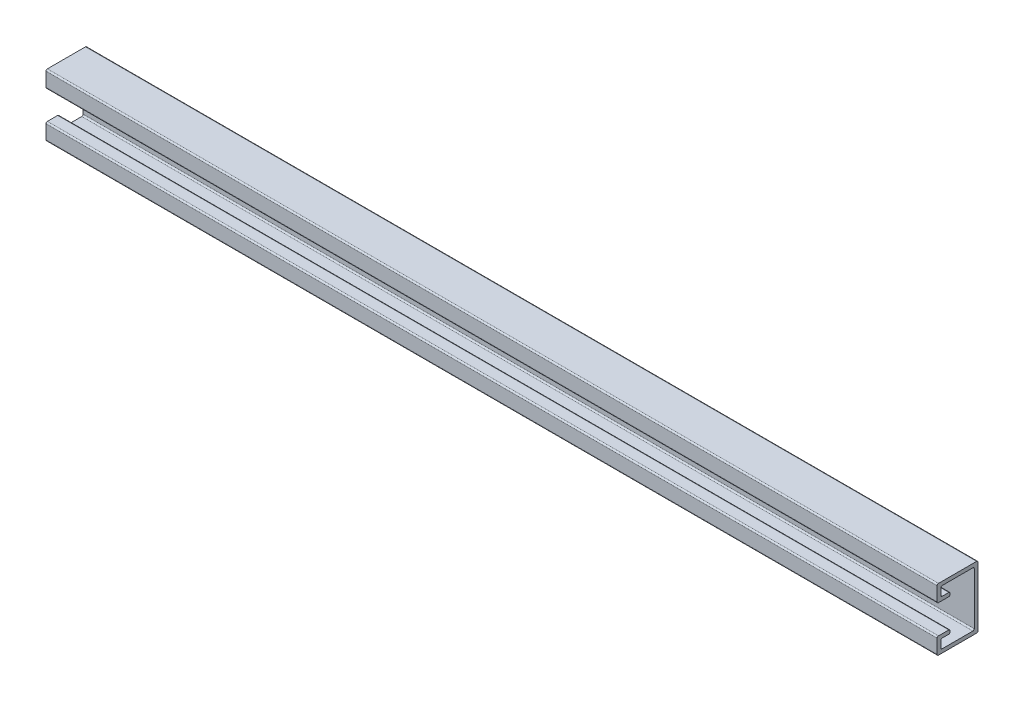
ISO-10303-21;
HEADER;
FILE_DESCRIPTION(('STEP AP214'),'2;1');
FILE_NAME('part.step','',(''),(''),'','','');
FILE_SCHEMA(('AUTOMOTIVE_DESIGN { 1 0 10303 214 1 1 1 1 }'));
ENDSEC;
DATA;
#1=APPLICATION_CONTEXT('core data for automotive mechanical design processes');
#2=APPLICATION_PROTOCOL_DEFINITION('international standard','automotive_design',2000,#1);
#3=PRODUCT_CONTEXT('',#1,'mechanical');
#4=PRODUCT('Part','Part','',(#3));
#5=PRODUCT_RELATED_PRODUCT_CATEGORY('part','',(#4));
#6=PRODUCT_DEFINITION_FORMATION('','',#4);
#7=PRODUCT_DEFINITION_CONTEXT('part definition',#1,'design');
#8=PRODUCT_DEFINITION('design','',#6,#7);
#9=PRODUCT_DEFINITION_SHAPE('','',#8);
#10=(LENGTH_UNIT() NAMED_UNIT(*) SI_UNIT(.MILLI.,.METRE.));
#11=(NAMED_UNIT(*) PLANE_ANGLE_UNIT() SI_UNIT($,.RADIAN.));
#12=(NAMED_UNIT(*) SI_UNIT($,.STERADIAN.) SOLID_ANGLE_UNIT());
#13=UNCERTAINTY_MEASURE_WITH_UNIT(LENGTH_MEASURE(1.E-05),#10,'distance_accuracy_value','');
#14=(GEOMETRIC_REPRESENTATION_CONTEXT(3) GLOBAL_UNCERTAINTY_ASSIGNED_CONTEXT((#13)) GLOBAL_UNIT_ASSIGNED_CONTEXT((#10,
#11,#12)) REPRESENTATION_CONTEXT('',''));
#15=CARTESIAN_POINT('',(0.,0.,0.));
#16=DIRECTION('',(0.,0.,1.));
#17=DIRECTION('',(1.,0.,0.));
#18=AXIS2_PLACEMENT_3D('',#15,#16,#17);
#19=CARTESIAN_POINT('',(1219.2,12.7,45.72));
#20=DIRECTION('',(0.,1.,0.));
#21=DIRECTION('',(0.,0.,1.));
#22=AXIS2_PLACEMENT_3D('',#19,#20,#21);
#23=PLANE('',#22);
#24=DIRECTION('',(0.,0.,-1.));
#25=VECTOR('',#24,1.);
#26=CARTESIAN_POINT('',(1219.2,12.7,45.72));
#27=LINE('',#26,#25);
#28=CARTESIAN_POINT('',(1219.2,12.7,43.815));
#29=VERTEX_POINT('',#28);
#30=CARTESIAN_POINT('',(1219.2,12.7,34.925));
#31=VERTEX_POINT('',#30);
#32=EDGE_CURVE('E245',#29,#31,#27,.T.);
#33=ORIENTED_EDGE('',*,*,#32,.F.);
#34=DIRECTION('',(-1.,0.,0.));
#35=VECTOR('',#34,1.);
#36=CARTESIAN_POINT('',(0.,12.7,43.815));
#37=LINE('',#36,#35);
#38=CARTESIAN_POINT('',(0.,12.7,43.815));
#39=VERTEX_POINT('',#38);
#40=EDGE_CURVE('E229',#29,#39,#37,.T.);
#41=ORIENTED_EDGE('',*,*,#40,.T.);
#42=DIRECTION('',(0.,0.,-1.));
#43=VECTOR('',#42,1.);
#44=CARTESIAN_POINT('',(0.,12.7,45.72));
#45=LINE('',#44,#43);
#46=CARTESIAN_POINT('',(0.,12.7,34.925));
#47=VERTEX_POINT('',#46);
#48=EDGE_CURVE('E242',#39,#47,#45,.T.);
#49=ORIENTED_EDGE('',*,*,#48,.T.);
#50=DIRECTION('',(-1.,0.,0.));
#51=VECTOR('',#50,1.);
#52=CARTESIAN_POINT('',(1219.2,12.7,34.925));
#53=LINE('',#52,#51);
#54=EDGE_CURVE('E248',#47,#31,#53,.F.);
#55=ORIENTED_EDGE('',*,*,#54,.T.);
#56=EDGE_LOOP('',(#33,#41,#49,#55));
#57=FACE_BOUND('',#56,.T.);
#58=ADVANCED_FACE('F14',(#57),#23,.F.);
#59=CARTESIAN_POINT('',(1219.2,17.78,33.02));
#60=DIRECTION('',(0.,0.,-1.));
#61=DIRECTION('',(-1.,0.,0.));
#62=AXIS2_PLACEMENT_3D('',#59,#60,#61);
#63=PLANE('',#62);
#64=DIRECTION('',(0.,-1.,0.));
#65=VECTOR('',#64,1.);
#66=CARTESIAN_POINT('',(1219.2,17.78,33.02));
#67=LINE('',#66,#65);
#68=CARTESIAN_POINT('',(1219.2,15.875,33.02));
#69=VERTEX_POINT('',#68);
#70=CARTESIAN_POINT('',(1219.2,14.605,33.02));
#71=VERTEX_POINT('',#70);
#72=EDGE_CURVE('E570',#69,#71,#67,.T.);
#73=ORIENTED_EDGE('',*,*,#72,.T.);
#74=DIRECTION('',(-1.,0.,0.));
#75=VECTOR('',#74,1.);
#76=CARTESIAN_POINT('',(0.,14.605,33.02));
#77=LINE('',#76,#75);
#78=CARTESIAN_POINT('',(0.,14.605,33.02));
#79=VERTEX_POINT('',#78);
#80=EDGE_CURVE('E448',#71,#79,#77,.T.);
#81=ORIENTED_EDGE('',*,*,#80,.T.);
#82=DIRECTION('',(0.,-1.,0.));
#83=VECTOR('',#82,1.);
#84=CARTESIAN_POINT('',(0.,17.78,33.02));
#85=LINE('',#84,#83);
#86=CARTESIAN_POINT('',(0.,15.875,33.02));
#87=VERTEX_POINT('',#86);
#88=EDGE_CURVE('E255',#87,#79,#85,.T.);
#89=ORIENTED_EDGE('',*,*,#88,.F.);
#90=DIRECTION('',(-1.,0.,0.));
#91=VECTOR('',#90,1.);
#92=CARTESIAN_POINT('',(1219.2,15.875,33.02));
#93=LINE('',#92,#91);
#94=EDGE_CURVE('E445',#87,#69,#93,.F.);
#95=ORIENTED_EDGE('',*,*,#94,.T.);
#96=EDGE_LOOP('',(#73,#81,#89,#95));
#97=FACE_BOUND('',#96,.T.);
#98=ADVANCED_FACE('F583',(#97),#63,.T.);
#99=CARTESIAN_POINT('',(1219.2,17.78,45.72));
#100=DIRECTION('',(0.,1.,0.));
#101=DIRECTION('',(0.,0.,1.));
#102=AXIS2_PLACEMENT_3D('',#99,#100,#101);
#103=PLANE('',#102);
#104=DIRECTION('',(0.,0.,-1.));
#105=VECTOR('',#104,1.);
#106=CARTESIAN_POINT('',(0.,17.78,45.72));
#107=LINE('',#106,#105);
#108=CARTESIAN_POINT('',(0.,17.78,48.895));
#109=VERTEX_POINT('',#108);
#110=CARTESIAN_POINT('',(0.,17.78,34.925));
#111=VERTEX_POINT('',#110);
#112=EDGE_CURVE('E259',#109,#111,#107,.T.);
#113=ORIENTED_EDGE('',*,*,#112,.F.);
#114=DIRECTION('',(-1.,0.,0.));
#115=VECTOR('',#114,1.);
#116=CARTESIAN_POINT('',(1219.2,17.78,48.895));
#117=LINE('',#116,#115);
#118=CARTESIAN_POINT('',(1219.2,17.78,48.895));
#119=VERTEX_POINT('',#118);
#120=EDGE_CURVE('E442',#109,#119,#117,.F.);
#121=ORIENTED_EDGE('',*,*,#120,.T.);
#122=DIRECTION('',(0.,0.,-1.));
#123=VECTOR('',#122,1.);
#124=CARTESIAN_POINT('',(1219.2,17.78,45.72));
#125=LINE('',#124,#123);
#126=CARTESIAN_POINT('',(1219.2,17.78,34.925));
#127=VERTEX_POINT('',#126);
#128=EDGE_CURVE('E566',#119,#127,#125,.T.);
#129=ORIENTED_EDGE('',*,*,#128,.T.);
#130=DIRECTION('',(-1.,0.,0.));
#131=VECTOR('',#130,1.);
#132=CARTESIAN_POINT('',(1219.2,17.78,34.925));
#133=LINE('',#132,#131);
#134=EDGE_CURVE('E438',#127,#111,#133,.T.);
#135=ORIENTED_EDGE('',*,*,#134,.T.);
#136=EDGE_LOOP('',(#113,#121,#129,#135));
#137=FACE_BOUND('',#136,.T.);
#138=ADVANCED_FACE('F591',(#137),#103,.T.);
#139=CARTESIAN_POINT('',(1219.2,0.,50.8));
#140=DIRECTION('',(0.,0.,1.));
#141=DIRECTION('',(0.,-1.,0.));
#142=AXIS2_PLACEMENT_3D('',#139,#140,#141);
#143=PLANE('',#142);
#144=DIRECTION('',(0.,1.,0.));
#145=VECTOR('',#144,1.);
#146=CARTESIAN_POINT('',(0.,0.,50.8));
#147=LINE('',#146,#145);
#148=CARTESIAN_POINT('',(0.,-3.175,50.8));
#149=VERTEX_POINT('',#148);
#150=CARTESIAN_POINT('',(0.,15.875,50.8));
#151=VERTEX_POINT('',#150);
#152=EDGE_CURVE('E268',#149,#151,#147,.T.);
#153=ORIENTED_EDGE('',*,*,#152,.F.);
#154=DIRECTION('',(-1.,0.,0.));
#155=VECTOR('',#154,1.);
#156=CARTESIAN_POINT('',(1219.2,-3.175,50.8));
#157=LINE('',#156,#155);
#158=CARTESIAN_POINT('',(1219.2,-3.175,50.8));
#159=VERTEX_POINT('',#158);
#160=EDGE_CURVE('E408',#149,#159,#157,.F.);
#161=ORIENTED_EDGE('',*,*,#160,.T.);
#162=DIRECTION('',(0.,1.,0.));
#163=VECTOR('',#162,1.);
#164=CARTESIAN_POINT('',(1219.2,0.,50.8));
#165=LINE('',#164,#163);
#166=CARTESIAN_POINT('',(1219.2,15.875,50.8));
#167=VERTEX_POINT('',#166);
#168=EDGE_CURVE('E562',#159,#167,#165,.T.);
#169=ORIENTED_EDGE('',*,*,#168,.T.);
#170=DIRECTION('',(-1.,0.,0.));
#171=VECTOR('',#170,1.);
#172=CARTESIAN_POINT('',(1219.2,15.875,50.8));
#173=LINE('',#172,#171);
#174=EDGE_CURVE('E404',#167,#151,#173,.T.);
#175=ORIENTED_EDGE('',*,*,#174,.T.);
#176=EDGE_LOOP('',(#153,#161,#169,#175));
#177=FACE_BOUND('',#176,.T.);
#178=ADVANCED_FACE('F601',(#177),#143,.T.);
#179=CARTESIAN_POINT('',(1219.2,-5.08,0.));
#180=DIRECTION('',(0.,-1.,0.));
#181=DIRECTION('',(0.,0.,-1.));
#182=AXIS2_PLACEMENT_3D('',#179,#180,#181);
#183=PLANE('',#182);
#184=DIRECTION('',(0.,0.,-1.));
#185=VECTOR('',#184,1.);
#186=CARTESIAN_POINT('',(1219.2,-5.08,0.));
#187=LINE('',#186,#185);
#188=CARTESIAN_POINT('',(1219.2,-5.08,-3.175));
#189=VERTEX_POINT('',#188);
#190=CARTESIAN_POINT('',(1219.2,-5.08,48.895));
#191=VERTEX_POINT('',#190);
#192=EDGE_CURVE('E558',#189,#191,#187,.F.);
#193=ORIENTED_EDGE('',*,*,#192,.T.);
#194=DIRECTION('',(-1.,0.,0.));
#195=VECTOR('',#194,1.);
#196=CARTESIAN_POINT('',(1219.2,-5.08,48.895));
#197=LINE('',#196,#195);
#198=CARTESIAN_POINT('',(0.,-5.08,48.895));
#199=VERTEX_POINT('',#198);
#200=EDGE_CURVE('E400',#191,#199,#197,.T.);
#201=ORIENTED_EDGE('',*,*,#200,.T.);
#202=DIRECTION('',(0.,0.,-1.));
#203=VECTOR('',#202,1.);
#204=CARTESIAN_POINT('',(0.,-5.08,0.));
#205=LINE('',#204,#203);
#206=CARTESIAN_POINT('',(0.,-5.08,-3.175));
#207=VERTEX_POINT('',#206);
#208=EDGE_CURVE('E272',#207,#199,#205,.F.);
#209=ORIENTED_EDGE('',*,*,#208,.F.);
#210=DIRECTION('',(-1.,0.,0.));
#211=VECTOR('',#210,1.);
#212=CARTESIAN_POINT('',(1219.2,-5.08,-3.175));
#213=LINE('',#212,#211);
#214=EDGE_CURVE('E397',#207,#189,#213,.F.);
#215=ORIENTED_EDGE('',*,*,#214,.T.);
#216=EDGE_LOOP('',(#193,#201,#209,#215));
#217=FACE_BOUND('',#216,.T.);
#218=ADVANCED_FACE('F609',(#217),#183,.T.);
#219=CARTESIAN_POINT('',(1219.2,0.,-5.08));
#220=DIRECTION('',(0.,0.,-1.));
#221=DIRECTION('',(-1.,0.,0.));
#222=AXIS2_PLACEMENT_3D('',#219,#220,#221);
#223=PLANE('',#222);
#224=DIRECTION('',(0.,1.,0.));
#225=VECTOR('',#224,1.);
#226=CARTESIAN_POINT('',(1219.2,0.,-5.08));
#227=LINE('',#226,#225);
#228=CARTESIAN_POINT('',(1219.2,78.105,-5.08));
#229=VERTEX_POINT('',#228);
#230=CARTESIAN_POINT('',(1219.2,-3.175,-5.08));
#231=VERTEX_POINT('',#230);
#232=EDGE_CURVE('E554',#229,#231,#227,.F.);
#233=ORIENTED_EDGE('',*,*,#232,.T.);
#234=DIRECTION('',(-1.,0.,0.));
#235=VECTOR('',#234,1.);
#236=CARTESIAN_POINT('',(1219.2,-3.175,-5.08));
#237=LINE('',#236,#235);
#238=CARTESIAN_POINT('',(0.,-3.175,-5.08));
#239=VERTEX_POINT('',#238);
#240=EDGE_CURVE('E427',#231,#239,#237,.T.);
#241=ORIENTED_EDGE('',*,*,#240,.T.);
#242=DIRECTION('',(0.,1.,0.));
#243=VECTOR('',#242,1.);
#244=CARTESIAN_POINT('',(0.,0.,-5.08));
#245=LINE('',#244,#243);
#246=CARTESIAN_POINT('',(0.,78.105,-5.08));
#247=VERTEX_POINT('',#246);
#248=EDGE_CURVE('E276',#247,#239,#245,.F.);
#249=ORIENTED_EDGE('',*,*,#248,.F.);
#250=DIRECTION('',(-1.,0.,0.));
#251=VECTOR('',#250,1.);
#252=CARTESIAN_POINT('',(1219.2,78.105,-5.08));
#253=LINE('',#252,#251);
#254=EDGE_CURVE('E424',#247,#229,#253,.F.);
#255=ORIENTED_EDGE('',*,*,#254,.T.);
#256=EDGE_LOOP('',(#233,#241,#249,#255));
#257=FACE_BOUND('',#256,.T.);
#258=ADVANCED_FACE('F619',(#257),#223,.T.);
#259=CARTESIAN_POINT('',(1219.2,80.01,0.));
#260=DIRECTION('',(0.,1.,0.));
#261=DIRECTION('',(0.,0.,1.));
#262=AXIS2_PLACEMENT_3D('',#259,#260,#261);
#263=PLANE('',#262);
#264=DIRECTION('',(0.,0.,-1.));
#265=VECTOR('',#264,1.);
#266=CARTESIAN_POINT('',(0.,80.01,0.));
#267=LINE('',#266,#265);
#268=CARTESIAN_POINT('',(0.,80.01,48.895));
#269=VERTEX_POINT('',#268);
#270=CARTESIAN_POINT('',(0.,80.01,-3.175));
#271=VERTEX_POINT('',#270);
#272=EDGE_CURVE('E280',#269,#271,#267,.T.);
#273=ORIENTED_EDGE('',*,*,#272,.F.);
#274=DIRECTION('',(-1.,0.,0.));
#275=VECTOR('',#274,1.);
#276=CARTESIAN_POINT('',(1219.2,80.01,48.895));
#277=LINE('',#276,#275);
#278=CARTESIAN_POINT('',(1219.2,80.01,48.895));
#279=VERTEX_POINT('',#278);
#280=EDGE_CURVE('E435',#269,#279,#277,.F.);
#281=ORIENTED_EDGE('',*,*,#280,.T.);
#282=DIRECTION('',(0.,0.,-1.));
#283=VECTOR('',#282,1.);
#284=CARTESIAN_POINT('',(1219.2,80.01,0.));
#285=LINE('',#284,#283);
#286=CARTESIAN_POINT('',(1219.2,80.01,-3.175));
#287=VERTEX_POINT('',#286);
#288=EDGE_CURVE('E550',#279,#287,#285,.T.);
#289=ORIENTED_EDGE('',*,*,#288,.T.);
#290=DIRECTION('',(-1.,0.,0.));
#291=VECTOR('',#290,1.);
#292=CARTESIAN_POINT('',(1219.2,80.01,-3.175));
#293=LINE('',#292,#291);
#294=EDGE_CURVE('E431',#287,#271,#293,.T.);
#295=ORIENTED_EDGE('',*,*,#294,.T.);
#296=EDGE_LOOP('',(#273,#281,#289,#295));
#297=FACE_BOUND('',#296,.T.);
#298=ADVANCED_FACE('F627',(#297),#263,.T.);
#299=CARTESIAN_POINT('',(1219.2,74.93,50.8));
#300=DIRECTION('',(0.,0.,1.));
#301=DIRECTION('',(1.,0.,0.));
#302=AXIS2_PLACEMENT_3D('',#299,#300,#301);
#303=PLANE('',#302);
#304=DIRECTION('',(0.,1.,0.));
#305=VECTOR('',#304,1.);
#306=CARTESIAN_POINT('',(0.,74.93,50.8));
#307=LINE('',#306,#305);
#308=CARTESIAN_POINT('',(0.,59.055,50.8));
#309=VERTEX_POINT('',#308);
#310=CARTESIAN_POINT('',(0.,78.105,50.8));
#311=VERTEX_POINT('',#310);
#312=EDGE_CURVE('E284',#309,#311,#307,.T.);
#313=ORIENTED_EDGE('',*,*,#312,.F.);
#314=DIRECTION('',(-1.,0.,0.));
#315=VECTOR('',#314,1.);
#316=CARTESIAN_POINT('',(1219.2,59.055,50.8));
#317=LINE('',#316,#315);
#318=CARTESIAN_POINT('',(1219.2,59.055,50.8));
#319=VERTEX_POINT('',#318);
#320=EDGE_CURVE('E364',#309,#319,#317,.F.);
#321=ORIENTED_EDGE('',*,*,#320,.T.);
#322=DIRECTION('',(0.,1.,0.));
#323=VECTOR('',#322,1.);
#324=CARTESIAN_POINT('',(1219.2,74.93,50.8));
#325=LINE('',#324,#323);
#326=CARTESIAN_POINT('',(1219.2,78.105,50.8));
#327=VERTEX_POINT('',#326);
#328=EDGE_CURVE('E546',#319,#327,#325,.T.);
#329=ORIENTED_EDGE('',*,*,#328,.T.);
#330=DIRECTION('',(-1.,0.,0.));
#331=VECTOR('',#330,1.);
#332=CARTESIAN_POINT('',(1219.2,78.105,50.8));
#333=LINE('',#332,#331);
#334=EDGE_CURVE('E360',#327,#311,#333,.T.);
#335=ORIENTED_EDGE('',*,*,#334,.T.);
#336=EDGE_LOOP('',(#313,#321,#329,#335));
#337=FACE_BOUND('',#336,.T.);
#338=ADVANCED_FACE('F636',(#337),#303,.T.);
#339=CARTESIAN_POINT('',(1219.2,57.15,45.72));
#340=DIRECTION('',(0.,-1.,0.));
#341=DIRECTION('',(0.,0.,-1.));
#342=AXIS2_PLACEMENT_3D('',#339,#340,#341);
#343=PLANE('',#342);
#344=DIRECTION('',(0.,0.,1.));
#345=VECTOR('',#344,1.);
#346=CARTESIAN_POINT('',(1219.2,57.15,45.72));
#347=LINE('',#346,#345);
#348=CARTESIAN_POINT('',(1219.2,57.15,34.925));
#349=VERTEX_POINT('',#348);
#350=CARTESIAN_POINT('',(1219.2,57.15,48.895));
#351=VERTEX_POINT('',#350);
#352=EDGE_CURVE('E542',#349,#351,#347,.T.);
#353=ORIENTED_EDGE('',*,*,#352,.T.);
#354=DIRECTION('',(-1.,0.,0.));
#355=VECTOR('',#354,1.);
#356=CARTESIAN_POINT('',(1219.2,57.15,48.895));
#357=LINE('',#356,#355);
#358=CARTESIAN_POINT('',(0.,57.15,48.895));
#359=VERTEX_POINT('',#358);
#360=EDGE_CURVE('E327',#351,#359,#357,.T.);
#361=ORIENTED_EDGE('',*,*,#360,.T.);
#362=DIRECTION('',(0.,0.,1.));
#363=VECTOR('',#362,1.);
#364=CARTESIAN_POINT('',(0.,57.15,45.72));
#365=LINE('',#364,#363);
#366=CARTESIAN_POINT('',(0.,57.15,34.925));
#367=VERTEX_POINT('',#366);
#368=EDGE_CURVE('E288',#367,#359,#365,.T.);
#369=ORIENTED_EDGE('',*,*,#368,.F.);
#370=DIRECTION('',(-1.,0.,0.));
#371=VECTOR('',#370,1.);
#372=CARTESIAN_POINT('',(1219.2,57.15,34.925));
#373=LINE('',#372,#371);
#374=EDGE_CURVE('E324',#367,#349,#373,.F.);
#375=ORIENTED_EDGE('',*,*,#374,.T.);
#376=EDGE_LOOP('',(#353,#361,#369,#375));
#377=FACE_BOUND('',#376,.T.);
#378=ADVANCED_FACE('F644',(#377),#343,.T.);
#379=CARTESIAN_POINT('',(1219.2,62.23,33.02));
#380=DIRECTION('',(0.,0.,-1.));
#381=DIRECTION('',(-1.,0.,0.));
#382=AXIS2_PLACEMENT_3D('',#379,#380,#381);
#383=PLANE('',#382);
#384=DIRECTION('',(0.,-1.,0.));
#385=VECTOR('',#384,1.);
#386=CARTESIAN_POINT('',(1219.2,62.23,33.02));
#387=LINE('',#386,#385);
#388=CARTESIAN_POINT('',(1219.2,60.325,33.02));
#389=VERTEX_POINT('',#388);
#390=CARTESIAN_POINT('',(1219.2,59.055,33.02));
#391=VERTEX_POINT('',#390);
#392=EDGE_CURVE('E538',#389,#391,#387,.T.);
#393=ORIENTED_EDGE('',*,*,#392,.T.);
#394=DIRECTION('',(-1.,0.,0.));
#395=VECTOR('',#394,1.);
#396=CARTESIAN_POINT('',(1219.2,59.055,33.02));
#397=LINE('',#396,#395);
#398=CARTESIAN_POINT('',(0.,59.055,33.02));
#399=VERTEX_POINT('',#398);
#400=EDGE_CURVE('E455',#391,#399,#397,.T.);
#401=ORIENTED_EDGE('',*,*,#400,.T.);
#402=DIRECTION('',(0.,-1.,0.));
#403=VECTOR('',#402,1.);
#404=CARTESIAN_POINT('',(0.,62.23,33.02));
#405=LINE('',#404,#403);
#406=CARTESIAN_POINT('',(0.,60.325,33.02));
#407=VERTEX_POINT('',#406);
#408=EDGE_CURVE('E291',#407,#399,#405,.T.);
#409=ORIENTED_EDGE('',*,*,#408,.F.);
#410=DIRECTION('',(-1.,0.,0.));
#411=VECTOR('',#410,1.);
#412=CARTESIAN_POINT('',(1219.2,60.325,33.02));
#413=LINE('',#412,#411);
#414=EDGE_CURVE('E452',#407,#389,#413,.F.);
#415=ORIENTED_EDGE('',*,*,#414,.T.);
#416=EDGE_LOOP('',(#393,#401,#409,#415));
#417=FACE_BOUND('',#416,.T.);
#418=ADVANCED_FACE('F654',(#417),#383,.T.);
#419=CARTESIAN_POINT('',(1219.2,62.23,45.72));
#420=DIRECTION('',(0.,-1.,0.));
#421=DIRECTION('',(0.,0.,-1.));
#422=AXIS2_PLACEMENT_3D('',#419,#420,#421);
#423=PLANE('',#422);
#424=DIRECTION('',(0.,0.,1.));
#425=VECTOR('',#424,1.);
#426=CARTESIAN_POINT('',(1219.2,62.23,45.72));
#427=LINE('',#426,#425);
#428=CARTESIAN_POINT('',(1219.2,62.23,34.925));
#429=VERTEX_POINT('',#428);
#430=CARTESIAN_POINT('',(1219.2,62.23,43.815));
#431=VERTEX_POINT('',#430);
#432=EDGE_CURVE('E534',#429,#431,#427,.T.);
#433=ORIENTED_EDGE('',*,*,#432,.F.);
#434=DIRECTION('',(-1.,0.,0.));
#435=VECTOR('',#434,1.);
#436=CARTESIAN_POINT('',(0.,62.23,34.925));
#437=LINE('',#436,#435);
#438=CARTESIAN_POINT('',(0.,62.23,34.925));
#439=VERTEX_POINT('',#438);
#440=EDGE_CURVE('E462',#429,#439,#437,.T.);
#441=ORIENTED_EDGE('',*,*,#440,.T.);
#442=DIRECTION('',(0.,0.,1.));
#443=VECTOR('',#442,1.);
#444=CARTESIAN_POINT('',(0.,62.23,45.72));
#445=LINE('',#444,#443);
#446=CARTESIAN_POINT('',(0.,62.23,43.815));
#447=VERTEX_POINT('',#446);
#448=EDGE_CURVE('E295',#439,#447,#445,.T.);
#449=ORIENTED_EDGE('',*,*,#448,.T.);
#450=DIRECTION('',(-1.,0.,0.));
#451=VECTOR('',#450,1.);
#452=CARTESIAN_POINT('',(1219.2,62.23,43.815));
#453=LINE('',#452,#451);
#454=EDGE_CURVE('E459',#447,#431,#453,.F.);
#455=ORIENTED_EDGE('',*,*,#454,.T.);
#456=EDGE_LOOP('',(#433,#441,#449,#455));
#457=FACE_BOUND('',#456,.T.);
#458=ADVANCED_FACE('F663',(#457),#423,.F.);
#459=CARTESIAN_POINT('',(1219.2,74.93,45.72));
#460=DIRECTION('',(0.,0.,1.));
#461=DIRECTION('',(1.,0.,0.));
#462=AXIS2_PLACEMENT_3D('',#459,#460,#461);
#463=PLANE('',#462);
#464=DIRECTION('',(0.,1.,0.));
#465=VECTOR('',#464,1.);
#466=CARTESIAN_POINT('',(1219.2,74.93,45.72));
#467=LINE('',#466,#465);
#468=CARTESIAN_POINT('',(1219.2,64.135,45.72));
#469=VERTEX_POINT('',#468);
#470=CARTESIAN_POINT('',(1219.2,73.025,45.72));
#471=VERTEX_POINT('',#470);
#472=EDGE_CURVE('E528',#469,#471,#467,.T.);
#473=ORIENTED_EDGE('',*,*,#472,.F.);
#474=DIRECTION('',(-1.,0.,0.));
#475=VECTOR('',#474,1.);
#476=CARTESIAN_POINT('',(0.,64.135,45.72));
#477=LINE('',#476,#475);
#478=CARTESIAN_POINT('',(0.,64.135,45.72));
#479=VERTEX_POINT('',#478);
#480=EDGE_CURVE('E469',#469,#479,#477,.T.);
#481=ORIENTED_EDGE('',*,*,#480,.T.);
#482=DIRECTION('',(0.,1.,0.));
#483=VECTOR('',#482,1.);
#484=CARTESIAN_POINT('',(0.,74.93,45.72));
#485=LINE('',#484,#483);
#486=CARTESIAN_POINT('',(0.,73.025,45.72));
#487=VERTEX_POINT('',#486);
#488=EDGE_CURVE('E299',#479,#487,#485,.T.);
#489=ORIENTED_EDGE('',*,*,#488,.T.);
#490=DIRECTION('',(-1.,0.,0.));
#491=VECTOR('',#490,1.);
#492=CARTESIAN_POINT('',(1219.2,73.025,45.72));
#493=LINE('',#492,#491);
#494=EDGE_CURVE('E466',#487,#471,#493,.F.);
#495=ORIENTED_EDGE('',*,*,#494,.T.);
#496=EDGE_LOOP('',(#473,#481,#489,#495));
#497=FACE_BOUND('',#496,.T.);
#498=ADVANCED_FACE('F672',(#497),#463,.F.);
#499=CARTESIAN_POINT('',(1219.2,74.93,0.));
#500=DIRECTION('',(0.,1.,0.));
#501=DIRECTION('',(0.,0.,1.));
#502=AXIS2_PLACEMENT_3D('',#499,#500,#501);
#503=PLANE('',#502);
#504=DIRECTION('',(0.,0.,-1.));
#505=VECTOR('',#504,1.);
#506=CARTESIAN_POINT('',(1219.2,74.93,0.));
#507=LINE('',#506,#505);
#508=CARTESIAN_POINT('',(1219.2,74.93,43.815));
#509=VERTEX_POINT('',#508);
#510=CARTESIAN_POINT('',(1219.2,74.93,1.905));
#511=VERTEX_POINT('',#510);
#512=EDGE_CURVE('E519',#509,#511,#507,.T.);
#513=ORIENTED_EDGE('',*,*,#512,.F.);
#514=DIRECTION('',(-1.,0.,0.));
#515=VECTOR('',#514,1.);
#516=CARTESIAN_POINT('',(0.,74.93,43.815));
#517=LINE('',#516,#515);
#518=CARTESIAN_POINT('',(0.,74.93,43.815));
#519=VERTEX_POINT('',#518);
#520=EDGE_CURVE('E237',#509,#519,#517,.T.);
#521=ORIENTED_EDGE('',*,*,#520,.T.);
#522=DIRECTION('',(0.,0.,-1.));
#523=VECTOR('',#522,1.);
#524=CARTESIAN_POINT('',(0.,74.93,0.));
#525=LINE('',#524,#523);
#526=CARTESIAN_POINT('',(0.,74.93,1.905));
#527=VERTEX_POINT('',#526);
#528=EDGE_CURVE('E303',#519,#527,#525,.T.);
#529=ORIENTED_EDGE('',*,*,#528,.T.);
#530=DIRECTION('',(-1.,0.,0.));
#531=VECTOR('',#530,1.);
#532=CARTESIAN_POINT('',(1219.2,74.93,1.905));
#533=LINE('',#532,#531);
#534=EDGE_CURVE('E473',#527,#511,#533,.F.);
#535=ORIENTED_EDGE('',*,*,#534,.T.);
#536=EDGE_LOOP('',(#513,#521,#529,#535));
#537=FACE_BOUND('',#536,.T.);
#538=ADVANCED_FACE('F511',(#537),#503,.F.);
#539=CARTESIAN_POINT('',(1219.2,0.,0.));
#540=DIRECTION('',(0.,0.,-1.));
#541=DIRECTION('',(-1.,0.,0.));
#542=AXIS2_PLACEMENT_3D('',#539,#540,#541);
#543=PLANE('',#542);
#544=DIRECTION('',(0.,-1.,0.));
#545=VECTOR('',#544,1.);
#546=CARTESIAN_POINT('',(0.,0.,0.));
#547=LINE('',#546,#545);
#548=CARTESIAN_POINT('',(0.,73.025,0.));
#549=VERTEX_POINT('',#548);
#550=CARTESIAN_POINT('',(0.,1.905,0.));
#551=VERTEX_POINT('',#550);
#552=EDGE_CURVE('E307',#549,#551,#547,.T.);
#553=ORIENTED_EDGE('',*,*,#552,.T.);
#554=DIRECTION('',(-1.,0.,0.));
#555=VECTOR('',#554,1.);
#556=CARTESIAN_POINT('',(1219.2,1.905,0.));
#557=LINE('',#556,#555);
#558=CARTESIAN_POINT('',(1219.2,1.905,0.));
#559=VERTEX_POINT('',#558);
#560=EDGE_CURVE('E421',#551,#559,#557,.F.);
#561=ORIENTED_EDGE('',*,*,#560,.T.);
#562=DIRECTION('',(0.,-1.,0.));
#563=VECTOR('',#562,1.);
#564=CARTESIAN_POINT('',(1219.2,0.,0.));
#565=LINE('',#564,#563);
#566=CARTESIAN_POINT('',(1219.2,73.025,0.));
#567=VERTEX_POINT('',#566);
#568=EDGE_CURVE('E518',#567,#559,#565,.T.);
#569=ORIENTED_EDGE('',*,*,#568,.F.);
#570=DIRECTION('',(-1.,0.,0.));
#571=VECTOR('',#570,1.);
#572=CARTESIAN_POINT('',(0.,73.025,0.));
#573=LINE('',#572,#571);
#574=EDGE_CURVE('E417',#567,#549,#573,.T.);
#575=ORIENTED_EDGE('',*,*,#574,.T.);
#576=EDGE_LOOP('',(#553,#561,#569,#575));
#577=FACE_BOUND('',#576,.T.);
#578=ADVANCED_FACE('F521',(#577),#543,.F.);
#579=CARTESIAN_POINT('',(1219.2,0.,0.));
#580=DIRECTION('',(0.,-1.,0.));
#581=DIRECTION('',(0.,0.,-1.));
#582=AXIS2_PLACEMENT_3D('',#579,#580,#581);
#583=PLANE('',#582);
#584=DIRECTION('',(0.,0.,1.));
#585=VECTOR('',#584,1.);
#586=CARTESIAN_POINT('',(1219.2,0.,0.));
#587=LINE('',#586,#585);
#588=CARTESIAN_POINT('',(1219.2,0.,1.905));
#589=VERTEX_POINT('',#588);
#590=CARTESIAN_POINT('',(1219.2,0.,43.815));
#591=VERTEX_POINT('',#590);
#592=EDGE_CURVE('E524',#589,#591,#587,.T.);
#593=ORIENTED_EDGE('',*,*,#592,.F.);
#594=DIRECTION('',(-1.,0.,0.));
#595=VECTOR('',#594,1.);
#596=CARTESIAN_POINT('',(0.,0.,1.905));
#597=LINE('',#596,#595);
#598=CARTESIAN_POINT('',(0.,0.,1.905));
#599=VERTEX_POINT('',#598);
#600=EDGE_CURVE('E413',#589,#599,#597,.T.);
#601=ORIENTED_EDGE('',*,*,#600,.T.);
#602=DIRECTION('',(0.,0.,1.));
#603=VECTOR('',#602,1.);
#604=CARTESIAN_POINT('',(0.,0.,0.));
#605=LINE('',#604,#603);
#606=CARTESIAN_POINT('',(0.,0.,43.815));
#607=VERTEX_POINT('',#606);
#608=EDGE_CURVE('E311',#599,#607,#605,.T.);
#609=ORIENTED_EDGE('',*,*,#608,.T.);
#610=DIRECTION('',(-1.,0.,0.));
#611=VECTOR('',#610,1.);
#612=CARTESIAN_POINT('',(1219.2,0.,43.815));
#613=LINE('',#612,#611);
#614=EDGE_CURVE('E30',#607,#591,#613,.F.);
#615=ORIENTED_EDGE('',*,*,#614,.T.);
#616=EDGE_LOOP('',(#593,#601,#609,#615));
#617=FACE_BOUND('',#616,.T.);
#618=ADVANCED_FACE('F849',(#617),#583,.F.);
#619=CARTESIAN_POINT('',(1219.2,0.,45.72));
#620=DIRECTION('',(0.,0.,1.));
#621=DIRECTION('',(0.,-1.,0.));
#622=AXIS2_PLACEMENT_3D('',#619,#620,#621);
#623=PLANE('',#622);
#624=DIRECTION('',(0.,1.,0.));
#625=VECTOR('',#624,1.);
#626=CARTESIAN_POINT('',(0.,0.,45.72));
#627=LINE('',#626,#625);
#628=CARTESIAN_POINT('',(0.,1.905,45.72));
#629=VERTEX_POINT('',#628);
#630=CARTESIAN_POINT('',(0.,10.795,45.72));
#631=VERTEX_POINT('',#630);
#632=EDGE_CURVE('E314',#629,#631,#627,.T.);
#633=ORIENTED_EDGE('',*,*,#632,.T.);
#634=DIRECTION('',(-1.,0.,0.));
#635=VECTOR('',#634,1.);
#636=CARTESIAN_POINT('',(1219.2,10.795,45.72));
#637=LINE('',#636,#635);
#638=CARTESIAN_POINT('',(1219.2,10.795,45.72));
#639=VERTEX_POINT('',#638);
#640=EDGE_CURVE('E230',#631,#639,#637,.F.);
#641=ORIENTED_EDGE('',*,*,#640,.T.);
#642=DIRECTION('',(0.,1.,0.));
#643=VECTOR('',#642,1.);
#644=CARTESIAN_POINT('',(1219.2,0.,45.72));
#645=LINE('',#644,#643);
#646=CARTESIAN_POINT('',(1219.2,1.905,45.72));
#647=VERTEX_POINT('',#646);
#648=EDGE_CURVE('E262',#647,#639,#645,.T.);
#649=ORIENTED_EDGE('',*,*,#648,.F.);
#650=DIRECTION('',(-1.,0.,0.));
#651=VECTOR('',#650,1.);
#652=CARTESIAN_POINT('',(0.,1.905,45.72));
#653=LINE('',#652,#651);
#654=EDGE_CURVE('E247',#647,#629,#653,.T.);
#655=ORIENTED_EDGE('',*,*,#654,.T.);
#656=EDGE_LOOP('',(#633,#641,#649,#655));
#657=FACE_BOUND('',#656,.T.);
#658=ADVANCED_FACE('F841',(#657),#623,.F.);
#659=CARTESIAN_POINT('',(1219.2,0.,0.));
#660=DIRECTION('',(-1.,0.,0.));
#661=DIRECTION('',(0.,0.,1.));
#662=AXIS2_PLACEMENT_3D('',#659,#660,#661);
#663=PLANE('',#662);
#664=ORIENTED_EDGE('',*,*,#328,.F.);
#665=CARTESIAN_POINT('',(1219.2,59.055,48.895));
#666=DIRECTION('',(-1.,0.,0.));
#667=DIRECTION('',(0.,0.,1.));
#668=AXIS2_PLACEMENT_3D('',#665,#666,#667);
#669=CIRCLE('',#668,1.905);
#670=EDGE_CURVE('E394',#319,#351,#669,.F.);
#671=ORIENTED_EDGE('',*,*,#670,.T.);
#672=ORIENTED_EDGE('',*,*,#352,.F.);
#673=CARTESIAN_POINT('',(1219.2,59.055,34.925));
#674=DIRECTION('',(-1.,0.,0.));
#675=DIRECTION('',(0.,0.,1.));
#676=AXIS2_PLACEMENT_3D('',#673,#674,#675);
#677=CIRCLE('',#676,1.905);
#678=EDGE_CURVE('E370',#349,#391,#677,.F.);
#679=ORIENTED_EDGE('',*,*,#678,.T.);
#680=ORIENTED_EDGE('',*,*,#392,.F.);
#681=CARTESIAN_POINT('',(1219.2,60.325,34.925));
#682=DIRECTION('',(-1.,0.,0.));
#683=DIRECTION('',(0.,0.,1.));
#684=AXIS2_PLACEMENT_3D('',#681,#682,#683);
#685=CIRCLE('',#684,1.905);
#686=EDGE_CURVE('E367',#389,#429,#685,.F.);
#687=ORIENTED_EDGE('',*,*,#686,.T.);
#688=ORIENTED_EDGE('',*,*,#432,.T.);
#689=CARTESIAN_POINT('',(1219.2,64.135,43.815));
#690=DIRECTION('',(-1.,0.,0.));
#691=DIRECTION('',(0.,0.,1.));
#692=AXIS2_PLACEMENT_3D('',#689,#690,#691);
#693=CIRCLE('',#692,1.905);
#694=EDGE_CURVE('E495',#431,#469,#693,.T.);
#695=ORIENTED_EDGE('',*,*,#694,.T.);
#696=ORIENTED_EDGE('',*,*,#472,.T.);
#697=CARTESIAN_POINT('',(1219.2,73.025,43.815));
#698=DIRECTION('',(-1.,0.,0.));
#699=DIRECTION('',(0.,0.,1.));
#700=AXIS2_PLACEMENT_3D('',#697,#698,#699);
#701=CIRCLE('',#700,1.905);
#702=EDGE_CURVE('E501',#471,#509,#701,.T.);
#703=ORIENTED_EDGE('',*,*,#702,.T.);
#704=ORIENTED_EDGE('',*,*,#512,.T.);
#705=CARTESIAN_POINT('',(1219.2,73.025,1.905));
#706=DIRECTION('',(-1.,0.,0.));
#707=DIRECTION('',(0.,0.,1.));
#708=AXIS2_PLACEMENT_3D('',#705,#706,#707);
#709=CIRCLE('',#708,1.905);
#710=EDGE_CURVE('E9',#511,#567,#709,.T.);
#711=ORIENTED_EDGE('',*,*,#710,.T.);
#712=ORIENTED_EDGE('',*,*,#568,.T.);
#713=CARTESIAN_POINT('',(1219.2,1.905,1.905));
#714=DIRECTION('',(-1.,0.,0.));
#715=DIRECTION('',(0.,0.,1.));
#716=AXIS2_PLACEMENT_3D('',#713,#714,#715);
#717=CIRCLE('',#716,1.905);
#718=EDGE_CURVE('E37',#559,#589,#717,.T.);
#719=ORIENTED_EDGE('',*,*,#718,.T.);
#720=ORIENTED_EDGE('',*,*,#592,.T.);
#721=CARTESIAN_POINT('',(1219.2,1.905,43.815));
#722=DIRECTION('',(-1.,0.,0.));
#723=DIRECTION('',(0.,0.,1.));
#724=AXIS2_PLACEMENT_3D('',#721,#722,#723);
#725=CIRCLE('',#724,1.905);
#726=EDGE_CURVE('E489',#591,#647,#725,.T.);
#727=ORIENTED_EDGE('',*,*,#726,.T.);
#728=ORIENTED_EDGE('',*,*,#648,.T.);
#729=CARTESIAN_POINT('',(1219.2,10.795,43.815));
#730=DIRECTION('',(-1.,0.,0.));
#731=DIRECTION('',(0.,0.,1.));
#732=AXIS2_PLACEMENT_3D('',#729,#730,#731);
#733=CIRCLE('',#732,1.905);
#734=EDGE_CURVE('E236',#639,#29,#733,.T.);
#735=ORIENTED_EDGE('',*,*,#734,.T.);
#736=ORIENTED_EDGE('',*,*,#32,.T.);
#737=CARTESIAN_POINT('',(1219.2,14.605,34.925));
#738=DIRECTION('',(-1.,0.,0.));
#739=DIRECTION('',(0.,0.,1.));
#740=AXIS2_PLACEMENT_3D('',#737,#738,#739);
#741=CIRCLE('',#740,1.905);
#742=EDGE_CURVE('E376',#31,#71,#741,.F.);
#743=ORIENTED_EDGE('',*,*,#742,.T.);
#744=ORIENTED_EDGE('',*,*,#72,.F.);
#745=CARTESIAN_POINT('',(1219.2,15.875,34.925));
#746=DIRECTION('',(-1.,0.,0.));
#747=DIRECTION('',(0.,0.,1.));
#748=AXIS2_PLACEMENT_3D('',#745,#746,#747);
#749=CIRCLE('',#748,1.905);
#750=EDGE_CURVE('E373',#69,#127,#749,.F.);
#751=ORIENTED_EDGE('',*,*,#750,.T.);
#752=ORIENTED_EDGE('',*,*,#128,.F.);
#753=CARTESIAN_POINT('',(1219.2,15.875,48.895));
#754=DIRECTION('',(-1.,0.,0.));
#755=DIRECTION('',(0.,0.,1.));
#756=AXIS2_PLACEMENT_3D('',#753,#754,#755);
#757=CIRCLE('',#756,1.905);
#758=EDGE_CURVE('E379',#119,#167,#757,.F.);
#759=ORIENTED_EDGE('',*,*,#758,.T.);
#760=ORIENTED_EDGE('',*,*,#168,.F.);
#761=CARTESIAN_POINT('',(1219.2,-3.175,48.895));
#762=DIRECTION('',(-1.,0.,0.));
#763=DIRECTION('',(0.,0.,1.));
#764=AXIS2_PLACEMENT_3D('',#761,#762,#763);
#765=CIRCLE('',#764,1.905);
#766=EDGE_CURVE('E391',#159,#191,#765,.F.);
#767=ORIENTED_EDGE('',*,*,#766,.T.);
#768=ORIENTED_EDGE('',*,*,#192,.F.);
#769=CARTESIAN_POINT('',(1219.2,-3.175,-3.175));
#770=DIRECTION('',(-1.,0.,0.));
#771=DIRECTION('',(0.,0.,1.));
#772=AXIS2_PLACEMENT_3D('',#769,#770,#771);
#773=CIRCLE('',#772,1.905);
#774=EDGE_CURVE('E388',#189,#231,#773,.F.);
#775=ORIENTED_EDGE('',*,*,#774,.T.);
#776=ORIENTED_EDGE('',*,*,#232,.F.);
#777=CARTESIAN_POINT('',(1219.2,78.105,-3.175));
#778=DIRECTION('',(-1.,0.,0.));
#779=DIRECTION('',(0.,0.,1.));
#780=AXIS2_PLACEMENT_3D('',#777,#778,#779);
#781=CIRCLE('',#780,1.905);
#782=EDGE_CURVE('E382',#229,#287,#781,.F.);
#783=ORIENTED_EDGE('',*,*,#782,.T.);
#784=ORIENTED_EDGE('',*,*,#288,.F.);
#785=CARTESIAN_POINT('',(1219.2,78.105,48.895));
#786=DIRECTION('',(-1.,0.,0.));
#787=DIRECTION('',(0.,0.,1.));
#788=AXIS2_PLACEMENT_3D('',#785,#786,#787);
#789=CIRCLE('',#788,1.905);
#790=EDGE_CURVE('E385',#279,#327,#789,.F.);
#791=ORIENTED_EDGE('',*,*,#790,.T.);
#792=EDGE_LOOP('',(#664,#671,#672,#679,#680,#687,#688,#695,#696,#703,#704,#711,#712,#719,#720,
#727,#728,#735,#736,#743,#744,#751,#752,#759,#760,#767,#768,#775,#776,#783,#784,#791));
#793=FACE_BOUND('',#792,.T.);
#794=ADVANCED_FACE('F517',(#793),#663,.F.);
#795=CARTESIAN_POINT('',(0.,0.,0.));
#796=DIRECTION('',(-1.,0.,0.));
#797=DIRECTION('',(0.,0.,1.));
#798=AXIS2_PLACEMENT_3D('',#795,#796,#797);
#799=PLANE('',#798);
#800=ORIENTED_EDGE('',*,*,#368,.T.);
#801=CARTESIAN_POINT('',(0.,59.055,48.895));
#802=DIRECTION('',(-1.,0.,0.));
#803=DIRECTION('',(0.,0.,1.));
#804=AXIS2_PLACEMENT_3D('',#801,#802,#803);
#805=CIRCLE('',#804,1.905);
#806=EDGE_CURVE('E357',#359,#309,#805,.T.);
#807=ORIENTED_EDGE('',*,*,#806,.T.);
#808=ORIENTED_EDGE('',*,*,#312,.T.);
#809=CARTESIAN_POINT('',(0.,78.105,48.895));
#810=DIRECTION('',(-1.,0.,0.));
#811=DIRECTION('',(0.,0.,1.));
#812=AXIS2_PLACEMENT_3D('',#809,#810,#811);
#813=CIRCLE('',#812,1.905);
#814=EDGE_CURVE('E348',#311,#269,#813,.T.);
#815=ORIENTED_EDGE('',*,*,#814,.T.);
#816=ORIENTED_EDGE('',*,*,#272,.T.);
#817=CARTESIAN_POINT('',(0.,78.105,-3.175));
#818=DIRECTION('',(-1.,0.,0.));
#819=DIRECTION('',(0.,0.,1.));
#820=AXIS2_PLACEMENT_3D('',#817,#818,#819);
#821=CIRCLE('',#820,1.905);
#822=EDGE_CURVE('E345',#271,#247,#821,.T.);
#823=ORIENTED_EDGE('',*,*,#822,.T.);
#824=ORIENTED_EDGE('',*,*,#248,.T.);
#825=CARTESIAN_POINT('',(0.,-3.175,-3.175));
#826=DIRECTION('',(-1.,0.,0.));
#827=DIRECTION('',(0.,0.,1.));
#828=AXIS2_PLACEMENT_3D('',#825,#826,#827);
#829=CIRCLE('',#828,1.905);
#830=EDGE_CURVE('E351',#239,#207,#829,.T.);
#831=ORIENTED_EDGE('',*,*,#830,.T.);
#832=ORIENTED_EDGE('',*,*,#208,.T.);
#833=CARTESIAN_POINT('',(0.,-3.175,48.895));
#834=DIRECTION('',(-1.,0.,0.));
#835=DIRECTION('',(0.,0.,1.));
#836=AXIS2_PLACEMENT_3D('',#833,#834,#835);
#837=CIRCLE('',#836,1.905);
#838=EDGE_CURVE('E354',#199,#149,#837,.T.);
#839=ORIENTED_EDGE('',*,*,#838,.T.);
#840=ORIENTED_EDGE('',*,*,#152,.T.);
#841=CARTESIAN_POINT('',(0.,15.875,48.895));
#842=DIRECTION('',(-1.,0.,0.));
#843=DIRECTION('',(0.,0.,1.));
#844=AXIS2_PLACEMENT_3D('',#841,#842,#843);
#845=CIRCLE('',#844,1.905);
#846=EDGE_CURVE('E342',#151,#109,#845,.T.);
#847=ORIENTED_EDGE('',*,*,#846,.T.);
#848=ORIENTED_EDGE('',*,*,#112,.T.);
#849=CARTESIAN_POINT('',(0.,15.875,34.925));
#850=DIRECTION('',(-1.,0.,0.));
#851=DIRECTION('',(0.,0.,1.));
#852=AXIS2_PLACEMENT_3D('',#849,#850,#851);
#853=CIRCLE('',#852,1.905);
#854=EDGE_CURVE('E337',#111,#87,#853,.T.);
#855=ORIENTED_EDGE('',*,*,#854,.T.);
#856=ORIENTED_EDGE('',*,*,#88,.T.);
#857=CARTESIAN_POINT('',(0.,14.605,34.925));
#858=DIRECTION('',(-1.,0.,0.));
#859=DIRECTION('',(0.,0.,1.));
#860=AXIS2_PLACEMENT_3D('',#857,#858,#859);
#861=CIRCLE('',#860,1.905);
#862=EDGE_CURVE('E253',#79,#47,#861,.T.);
#863=ORIENTED_EDGE('',*,*,#862,.T.);
#864=ORIENTED_EDGE('',*,*,#48,.F.);
#865=CARTESIAN_POINT('',(0.,10.795,43.815));
#866=DIRECTION('',(-1.,0.,0.));
#867=DIRECTION('',(0.,0.,1.));
#868=AXIS2_PLACEMENT_3D('',#865,#866,#867);
#869=CIRCLE('',#868,1.905);
#870=EDGE_CURVE('E225',#39,#631,#869,.F.);
#871=ORIENTED_EDGE('',*,*,#870,.T.);
#872=ORIENTED_EDGE('',*,*,#632,.F.);
#873=CARTESIAN_POINT('',(0.,1.905,43.815));
#874=DIRECTION('',(-1.,0.,0.));
#875=DIRECTION('',(0.,0.,1.));
#876=AXIS2_PLACEMENT_3D('',#873,#874,#875);
#877=CIRCLE('',#876,1.905);
#878=EDGE_CURVE('E486',#629,#607,#877,.F.);
#879=ORIENTED_EDGE('',*,*,#878,.T.);
#880=ORIENTED_EDGE('',*,*,#608,.F.);
#881=CARTESIAN_POINT('',(0.,1.905,1.905));
#882=DIRECTION('',(-1.,0.,0.));
#883=DIRECTION('',(0.,0.,1.));
#884=AXIS2_PLACEMENT_3D('',#881,#882,#883);
#885=CIRCLE('',#884,1.905);
#886=EDGE_CURVE('E481',#599,#551,#885,.F.);
#887=ORIENTED_EDGE('',*,*,#886,.T.);
#888=ORIENTED_EDGE('',*,*,#552,.F.);
#889=CARTESIAN_POINT('',(0.,73.025,1.905));
#890=DIRECTION('',(-1.,0.,0.));
#891=DIRECTION('',(0.,0.,1.));
#892=AXIS2_PLACEMENT_3D('',#889,#890,#891);
#893=CIRCLE('',#892,1.905);
#894=EDGE_CURVE('E23',#549,#527,#893,.F.);
#895=ORIENTED_EDGE('',*,*,#894,.T.);
#896=ORIENTED_EDGE('',*,*,#528,.F.);
#897=CARTESIAN_POINT('',(0.,73.025,43.815));
#898=DIRECTION('',(-1.,0.,0.));
#899=DIRECTION('',(0.,0.,1.));
#900=AXIS2_PLACEMENT_3D('',#897,#898,#899);
#901=CIRCLE('',#900,1.905);
#902=EDGE_CURVE('E498',#519,#487,#901,.F.);
#903=ORIENTED_EDGE('',*,*,#902,.T.);
#904=ORIENTED_EDGE('',*,*,#488,.F.);
#905=CARTESIAN_POINT('',(0.,64.135,43.815));
#906=DIRECTION('',(-1.,0.,0.));
#907=DIRECTION('',(0.,0.,1.));
#908=AXIS2_PLACEMENT_3D('',#905,#906,#907);
#909=CIRCLE('',#908,1.905);
#910=EDGE_CURVE('E492',#479,#447,#909,.F.);
#911=ORIENTED_EDGE('',*,*,#910,.T.);
#912=ORIENTED_EDGE('',*,*,#448,.F.);
#913=CARTESIAN_POINT('',(0.,60.325,34.925));
#914=DIRECTION('',(-1.,0.,0.));
#915=DIRECTION('',(0.,0.,1.));
#916=AXIS2_PLACEMENT_3D('',#913,#914,#915);
#917=CIRCLE('',#916,1.905);
#918=EDGE_CURVE('E331',#439,#407,#917,.T.);
#919=ORIENTED_EDGE('',*,*,#918,.T.);
#920=ORIENTED_EDGE('',*,*,#408,.T.);
#921=CARTESIAN_POINT('',(0.,59.055,34.925));
#922=DIRECTION('',(-1.,0.,0.));
#923=DIRECTION('',(0.,0.,1.));
#924=AXIS2_PLACEMENT_3D('',#921,#922,#923);
#925=CIRCLE('',#924,1.905);
#926=EDGE_CURVE('E334',#399,#367,#925,.T.);
#927=ORIENTED_EDGE('',*,*,#926,.T.);
#928=EDGE_LOOP('',(#800,#807,#808,#815,#816,#823,#824,#831,#832,#839,#840,#847,#848,#855,#856,
#863,#864,#871,#872,#879,#880,#887,#888,#895,#896,#903,#904,#911,#912,#919,#920,#927));
#929=FACE_BOUND('',#928,.T.);
#930=ADVANCED_FACE('F251',(#929),#799,.T.);
#931=CARTESIAN_POINT('',(1219.2,10.795,43.815));
#932=DIRECTION('',(1.,0.,0.));
#933=DIRECTION('',(0.,0.,-1.));
#934=AXIS2_PLACEMENT_3D('',#931,#932,#933);
#935=CYLINDRICAL_SURFACE('',#934,1.905);
#936=ORIENTED_EDGE('',*,*,#734,.F.);
#937=ORIENTED_EDGE('',*,*,#640,.F.);
#938=ORIENTED_EDGE('',*,*,#870,.F.);
#939=ORIENTED_EDGE('',*,*,#40,.F.);
#940=EDGE_LOOP('',(#936,#937,#938,#939));
#941=FACE_BOUND('',#940,.T.);
#942=ADVANCED_FACE('F228',(#941),#935,.F.);
#943=CARTESIAN_POINT('',(1219.2,59.055,48.895));
#944=DIRECTION('',(-1.,0.,0.));
#945=DIRECTION('',(0.,0.,1.));
#946=AXIS2_PLACEMENT_3D('',#943,#944,#945);
#947=CYLINDRICAL_SURFACE('',#946,1.905);
#948=ORIENTED_EDGE('',*,*,#670,.F.);
#949=ORIENTED_EDGE('',*,*,#320,.F.);
#950=ORIENTED_EDGE('',*,*,#806,.F.);
#951=ORIENTED_EDGE('',*,*,#360,.F.);
#952=EDGE_LOOP('',(#948,#949,#950,#951));
#953=FACE_BOUND('',#952,.T.);
#954=ADVANCED_FACE('F642',(#953),#947,.T.);
#955=CARTESIAN_POINT('',(1219.2,-3.175,48.895));
#956=DIRECTION('',(-1.,0.,0.));
#957=DIRECTION('',(0.,0.,1.));
#958=AXIS2_PLACEMENT_3D('',#955,#956,#957);
#959=CYLINDRICAL_SURFACE('',#958,1.905);
#960=ORIENTED_EDGE('',*,*,#766,.F.);
#961=ORIENTED_EDGE('',*,*,#160,.F.);
#962=ORIENTED_EDGE('',*,*,#838,.F.);
#963=ORIENTED_EDGE('',*,*,#200,.F.);
#964=EDGE_LOOP('',(#960,#961,#962,#963));
#965=FACE_BOUND('',#964,.T.);
#966=ADVANCED_FACE('F607',(#965),#959,.T.);
#967=CARTESIAN_POINT('',(1219.2,1.905,1.905));
#968=DIRECTION('',(1.,0.,0.));
#969=DIRECTION('',(0.,0.,-1.));
#970=AXIS2_PLACEMENT_3D('',#967,#968,#969);
#971=CYLINDRICAL_SURFACE('',#970,1.905);
#972=ORIENTED_EDGE('',*,*,#718,.F.);
#973=ORIENTED_EDGE('',*,*,#560,.F.);
#974=ORIENTED_EDGE('',*,*,#886,.F.);
#975=ORIENTED_EDGE('',*,*,#600,.F.);
#976=EDGE_LOOP('',(#972,#973,#974,#975));
#977=FACE_BOUND('',#976,.T.);
#978=ADVANCED_FACE('F700',(#977),#971,.F.);
#979=CARTESIAN_POINT('',(1219.2,-3.175,-3.175));
#980=DIRECTION('',(-1.,0.,0.));
#981=DIRECTION('',(0.,0.,1.));
#982=AXIS2_PLACEMENT_3D('',#979,#980,#981);
#983=CYLINDRICAL_SURFACE('',#982,1.905);
#984=ORIENTED_EDGE('',*,*,#774,.F.);
#985=ORIENTED_EDGE('',*,*,#214,.F.);
#986=ORIENTED_EDGE('',*,*,#830,.F.);
#987=ORIENTED_EDGE('',*,*,#240,.F.);
#988=EDGE_LOOP('',(#984,#985,#986,#987));
#989=FACE_BOUND('',#988,.T.);
#990=ADVANCED_FACE('F616',(#989),#983,.T.);
#991=CARTESIAN_POINT('',(1219.2,78.105,48.895));
#992=DIRECTION('',(-1.,0.,0.));
#993=DIRECTION('',(0.,0.,1.));
#994=AXIS2_PLACEMENT_3D('',#991,#992,#993);
#995=CYLINDRICAL_SURFACE('',#994,1.905);
#996=ORIENTED_EDGE('',*,*,#790,.F.);
#997=ORIENTED_EDGE('',*,*,#280,.F.);
#998=ORIENTED_EDGE('',*,*,#814,.F.);
#999=ORIENTED_EDGE('',*,*,#334,.F.);
#1000=EDGE_LOOP('',(#996,#997,#998,#999));
#1001=FACE_BOUND('',#1000,.T.);
#1002=ADVANCED_FACE('F633',(#1001),#995,.T.);
#1003=CARTESIAN_POINT('',(1219.2,78.105,-3.175));
#1004=DIRECTION('',(-1.,0.,0.));
#1005=DIRECTION('',(0.,0.,1.));
#1006=AXIS2_PLACEMENT_3D('',#1003,#1004,#1005);
#1007=CYLINDRICAL_SURFACE('',#1006,1.905);
#1008=ORIENTED_EDGE('',*,*,#782,.F.);
#1009=ORIENTED_EDGE('',*,*,#254,.F.);
#1010=ORIENTED_EDGE('',*,*,#822,.F.);
#1011=ORIENTED_EDGE('',*,*,#294,.F.);
#1012=EDGE_LOOP('',(#1008,#1009,#1010,#1011));
#1013=FACE_BOUND('',#1012,.T.);
#1014=ADVANCED_FACE('F625',(#1013),#1007,.T.);
#1015=CARTESIAN_POINT('',(1219.2,1.905,43.815));
#1016=DIRECTION('',(1.,0.,0.));
#1017=DIRECTION('',(0.,0.,-1.));
#1018=AXIS2_PLACEMENT_3D('',#1015,#1016,#1017);
#1019=CYLINDRICAL_SURFACE('',#1018,1.905);
#1020=ORIENTED_EDGE('',*,*,#726,.F.);
#1021=ORIENTED_EDGE('',*,*,#614,.F.);
#1022=ORIENTED_EDGE('',*,*,#878,.F.);
#1023=ORIENTED_EDGE('',*,*,#654,.F.);
#1024=EDGE_LOOP('',(#1020,#1021,#1022,#1023));
#1025=FACE_BOUND('',#1024,.T.);
#1026=ADVANCED_FACE('F710',(#1025),#1019,.F.);
#1027=CARTESIAN_POINT('',(1219.2,15.875,48.895));
#1028=DIRECTION('',(-1.,0.,0.));
#1029=DIRECTION('',(0.,0.,1.));
#1030=AXIS2_PLACEMENT_3D('',#1027,#1028,#1029);
#1031=CYLINDRICAL_SURFACE('',#1030,1.905);
#1032=ORIENTED_EDGE('',*,*,#758,.F.);
#1033=ORIENTED_EDGE('',*,*,#120,.F.);
#1034=ORIENTED_EDGE('',*,*,#846,.F.);
#1035=ORIENTED_EDGE('',*,*,#174,.F.);
#1036=EDGE_LOOP('',(#1032,#1033,#1034,#1035));
#1037=FACE_BOUND('',#1036,.T.);
#1038=ADVANCED_FACE('F598',(#1037),#1031,.T.);
#1039=CARTESIAN_POINT('',(1219.2,14.605,34.925));
#1040=DIRECTION('',(1.,0.,0.));
#1041=DIRECTION('',(0.,0.,-1.));
#1042=AXIS2_PLACEMENT_3D('',#1039,#1040,#1041);
#1043=CYLINDRICAL_SURFACE('',#1042,1.905);
#1044=ORIENTED_EDGE('',*,*,#742,.F.);
#1045=ORIENTED_EDGE('',*,*,#54,.F.);
#1046=ORIENTED_EDGE('',*,*,#862,.F.);
#1047=ORIENTED_EDGE('',*,*,#80,.F.);
#1048=EDGE_LOOP('',(#1044,#1045,#1046,#1047));
#1049=FACE_BOUND('',#1048,.T.);
#1050=ADVANCED_FACE('F580',(#1049),#1043,.T.);
#1051=CARTESIAN_POINT('',(1219.2,15.875,34.925));
#1052=DIRECTION('',(-1.,0.,0.));
#1053=DIRECTION('',(0.,0.,1.));
#1054=AXIS2_PLACEMENT_3D('',#1051,#1052,#1053);
#1055=CYLINDRICAL_SURFACE('',#1054,1.905);
#1056=ORIENTED_EDGE('',*,*,#750,.F.);
#1057=ORIENTED_EDGE('',*,*,#94,.F.);
#1058=ORIENTED_EDGE('',*,*,#854,.F.);
#1059=ORIENTED_EDGE('',*,*,#134,.F.);
#1060=EDGE_LOOP('',(#1056,#1057,#1058,#1059));
#1061=FACE_BOUND('',#1060,.T.);
#1062=ADVANCED_FACE('F589',(#1061),#1055,.T.);
#1063=CARTESIAN_POINT('',(1219.2,59.055,34.925));
#1064=DIRECTION('',(-1.,0.,0.));
#1065=DIRECTION('',(0.,0.,1.));
#1066=AXIS2_PLACEMENT_3D('',#1063,#1064,#1065);
#1067=CYLINDRICAL_SURFACE('',#1066,1.905);
#1068=ORIENTED_EDGE('',*,*,#678,.F.);
#1069=ORIENTED_EDGE('',*,*,#374,.F.);
#1070=ORIENTED_EDGE('',*,*,#926,.F.);
#1071=ORIENTED_EDGE('',*,*,#400,.F.);
#1072=EDGE_LOOP('',(#1068,#1069,#1070,#1071));
#1073=FACE_BOUND('',#1072,.T.);
#1074=ADVANCED_FACE('F651',(#1073),#1067,.T.);
#1075=CARTESIAN_POINT('',(1219.2,60.325,34.925));
#1076=DIRECTION('',(1.,0.,0.));
#1077=DIRECTION('',(0.,0.,-1.));
#1078=AXIS2_PLACEMENT_3D('',#1075,#1076,#1077);
#1079=CYLINDRICAL_SURFACE('',#1078,1.905);
#1080=ORIENTED_EDGE('',*,*,#686,.F.);
#1081=ORIENTED_EDGE('',*,*,#414,.F.);
#1082=ORIENTED_EDGE('',*,*,#918,.F.);
#1083=ORIENTED_EDGE('',*,*,#440,.F.);
#1084=EDGE_LOOP('',(#1080,#1081,#1082,#1083));
#1085=FACE_BOUND('',#1084,.T.);
#1086=ADVANCED_FACE('F660',(#1085),#1079,.T.);
#1087=CARTESIAN_POINT('',(1219.2,64.135,43.815));
#1088=DIRECTION('',(1.,0.,0.));
#1089=DIRECTION('',(0.,0.,-1.));
#1090=AXIS2_PLACEMENT_3D('',#1087,#1088,#1089);
#1091=CYLINDRICAL_SURFACE('',#1090,1.905);
#1092=ORIENTED_EDGE('',*,*,#694,.F.);
#1093=ORIENTED_EDGE('',*,*,#454,.F.);
#1094=ORIENTED_EDGE('',*,*,#910,.F.);
#1095=ORIENTED_EDGE('',*,*,#480,.F.);
#1096=EDGE_LOOP('',(#1092,#1093,#1094,#1095));
#1097=FACE_BOUND('',#1096,.T.);
#1098=ADVANCED_FACE('F669',(#1097),#1091,.F.);
#1099=CARTESIAN_POINT('',(1219.2,73.025,43.815));
#1100=DIRECTION('',(1.,0.,0.));
#1101=DIRECTION('',(0.,0.,-1.));
#1102=AXIS2_PLACEMENT_3D('',#1099,#1100,#1101);
#1103=CYLINDRICAL_SURFACE('',#1102,1.905);
#1104=ORIENTED_EDGE('',*,*,#702,.F.);
#1105=ORIENTED_EDGE('',*,*,#494,.F.);
#1106=ORIENTED_EDGE('',*,*,#902,.F.);
#1107=ORIENTED_EDGE('',*,*,#520,.F.);
#1108=EDGE_LOOP('',(#1104,#1105,#1106,#1107));
#1109=FACE_BOUND('',#1108,.T.);
#1110=ADVANCED_FACE('F676',(#1109),#1103,.F.);
#1111=CARTESIAN_POINT('',(1219.2,73.025,1.905));
#1112=DIRECTION('',(1.,0.,0.));
#1113=DIRECTION('',(0.,0.,-1.));
#1114=AXIS2_PLACEMENT_3D('',#1111,#1112,#1113);
#1115=CYLINDRICAL_SURFACE('',#1114,1.905);
#1116=ORIENTED_EDGE('',*,*,#710,.F.);
#1117=ORIENTED_EDGE('',*,*,#534,.F.);
#1118=ORIENTED_EDGE('',*,*,#894,.F.);
#1119=ORIENTED_EDGE('',*,*,#574,.F.);
#1120=EDGE_LOOP('',(#1116,#1117,#1118,#1119));
#1121=FACE_BOUND('',#1120,.T.);
#1122=ADVANCED_FACE('F16',(#1121),#1115,.F.);
#1123=CLOSED_SHELL('',(#58,#98,#138,#178,#218,#258,#298,#338,#378,#418,#458,#498,#538,#578,#618,
#658,#794,#930,#942,#954,#966,#978,#990,#1002,#1014,#1026,#1038,#1050,#1062,#1074,#1086,#1098,
#1110,#1122));
#1124=MANIFOLD_SOLID_BREP('B1',#1123);
#1125=ADVANCED_BREP_SHAPE_REPRESENTATION('',(#18,#1124),#14);
#1126=SHAPE_DEFINITION_REPRESENTATION(#9,#1125);
ENDSEC;
END-ISO-10303-21;
